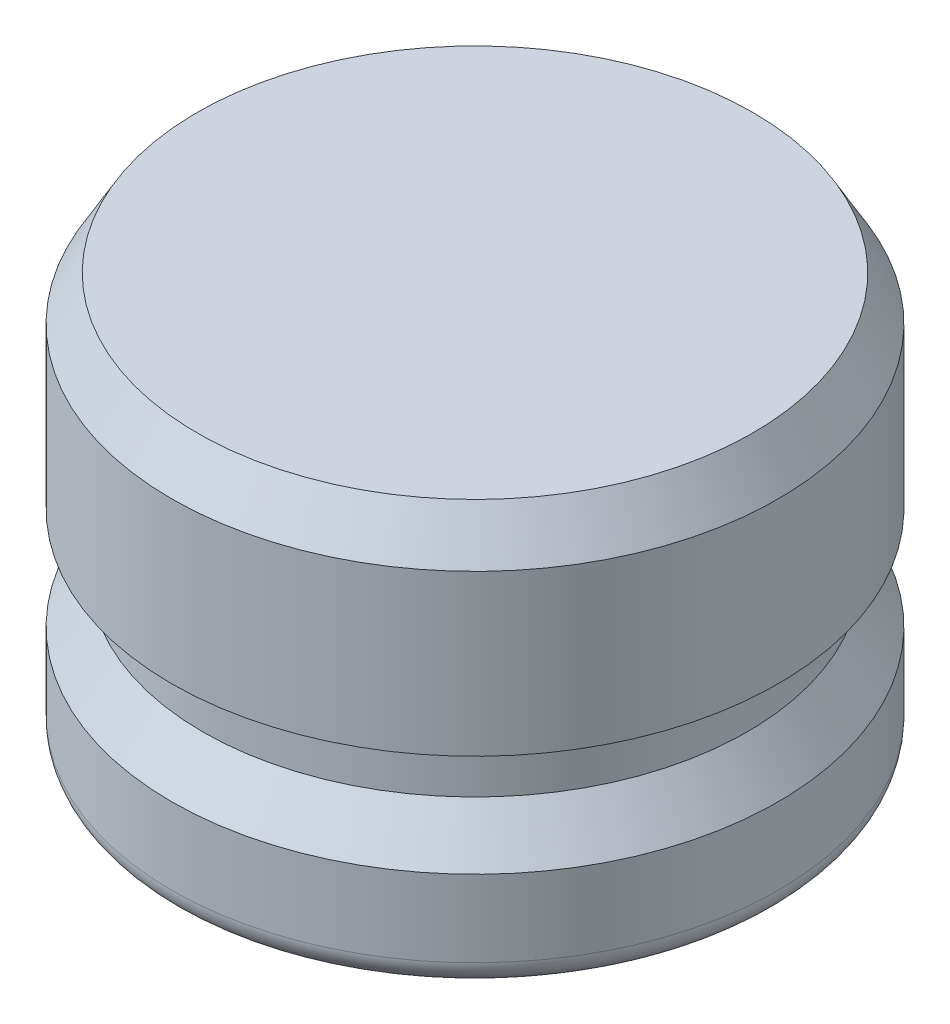
ISO-10303-21;
HEADER;
FILE_DESCRIPTION(('STEP AP214'),'2;1');
FILE_NAME('part.step','',(''),(''),'','','');
FILE_SCHEMA(('AUTOMOTIVE_DESIGN { 1 0 10303 214 1 1 1 1 }'));
ENDSEC;
DATA;
#1=APPLICATION_CONTEXT('core data for automotive mechanical design processes');
#2=APPLICATION_PROTOCOL_DEFINITION('international standard','automotive_design',2000,#1);
#3=PRODUCT_CONTEXT('',#1,'mechanical');
#4=PRODUCT('Part','Part','',(#3));
#5=PRODUCT_RELATED_PRODUCT_CATEGORY('part','',(#4));
#6=PRODUCT_DEFINITION_FORMATION('','',#4);
#7=PRODUCT_DEFINITION_CONTEXT('part definition',#1,'design');
#8=PRODUCT_DEFINITION('design','',#6,#7);
#9=PRODUCT_DEFINITION_SHAPE('','',#8);
#10=(LENGTH_UNIT() NAMED_UNIT(*) SI_UNIT(.MILLI.,.METRE.));
#11=(NAMED_UNIT(*) PLANE_ANGLE_UNIT() SI_UNIT($,.RADIAN.));
#12=(NAMED_UNIT(*) SI_UNIT($,.STERADIAN.) SOLID_ANGLE_UNIT());
#13=UNCERTAINTY_MEASURE_WITH_UNIT(LENGTH_MEASURE(1.E-05),#10,'distance_accuracy_value','');
#14=(GEOMETRIC_REPRESENTATION_CONTEXT(3) GLOBAL_UNCERTAINTY_ASSIGNED_CONTEXT((#13)) GLOBAL_UNIT_ASSIGNED_CONTEXT((#10,
#11,#12)) REPRESENTATION_CONTEXT('',''));
#15=CARTESIAN_POINT('',(0.,0.,0.));
#16=DIRECTION('',(0.,0.,1.));
#17=DIRECTION('',(1.,0.,0.));
#18=AXIS2_PLACEMENT_3D('',#15,#16,#17);
#19=CARTESIAN_POINT('',(0.,0.,0.));
#20=DIRECTION('',(0.,1.,0.));
#21=DIRECTION('',(0.,0.,1.));
#22=AXIS2_PLACEMENT_3D('',#19,#20,#21);
#23=PLANE('',#22);
#24=CARTESIAN_POINT('',(0.,0.,0.));
#25=DIRECTION('',(0.,1.,0.));
#26=DIRECTION('',(0.,0.,1.));
#27=AXIS2_PLACEMENT_3D('',#24,#25,#26);
#28=CIRCLE('',#27,8.62965);
#29=CARTESIAN_POINT('',(0.,0.,8.62965));
#30=VERTEX_POINT('',#29);
#31=EDGE_CURVE('E46',#30,#30,#28,.F.);
#32=ORIENTED_EDGE('',*,*,#31,.T.);
#33=EDGE_LOOP('',(#32));
#34=FACE_BOUND('',#33,.T.);
#35=ADVANCED_FACE('F31',(#34),#23,.F.);
#36=CARTESIAN_POINT('',(0.,0.,0.));
#37=DIRECTION('',(0.,-1.,0.));
#38=DIRECTION('',(0.,0.,-1.));
#39=AXIS2_PLACEMENT_3D('',#36,#37,#38);
#40=CYLINDRICAL_SURFACE('',#39,9.4234);
#41=CARTESIAN_POINT('',(0.,0.793749999999999,0.));
#42=DIRECTION('',(0.,1.,0.));
#43=DIRECTION('',(0.,0.,1.));
#44=AXIS2_PLACEMENT_3D('',#41,#42,#43);
#45=CIRCLE('',#44,9.4234);
#46=CARTESIAN_POINT('',(0.,0.793749999999999,9.4234));
#47=VERTEX_POINT('',#46);
#48=EDGE_CURVE('E42',#47,#47,#45,.T.);
#49=ORIENTED_EDGE('',*,*,#48,.T.);
#50=EDGE_LOOP('',(#49));
#51=FACE_BOUND('',#50,.T.);
#52=CARTESIAN_POINT('',(0.,3.175,0.));
#53=DIRECTION('',(0.,-1.,0.));
#54=DIRECTION('',(0.,0.,-1.));
#55=AXIS2_PLACEMENT_3D('',#52,#53,#54);
#56=CIRCLE('',#55,9.4234);
#57=CARTESIAN_POINT('',(0.,3.175,-9.4234));
#58=VERTEX_POINT('',#57);
#59=EDGE_CURVE('E51',#58,#58,#56,.T.);
#60=ORIENTED_EDGE('',*,*,#59,.T.);
#61=EDGE_LOOP('',(#60));
#62=FACE_BOUND('',#61,.T.);
#63=ADVANCED_FACE('F80',(#51,#62),#40,.T.);
#64=CARTESIAN_POINT('',(0.,4.572,0.));
#65=DIRECTION('',(0.,-1.,0.));
#66=DIRECTION('',(0.,0.,-1.));
#67=AXIS2_PLACEMENT_3D('',#64,#65,#66);
#68=CONICAL_SURFACE('',#67,8.4582,0.604598590093476);
#69=ORIENTED_EDGE('',*,*,#59,.F.);
#70=EDGE_LOOP('',(#69));
#71=FACE_BOUND('',#70,.T.);
#72=CARTESIAN_POINT('',(0.,4.572,0.));
#73=DIRECTION('',(0.,-1.,0.));
#74=DIRECTION('',(0.,0.,-1.));
#75=AXIS2_PLACEMENT_3D('',#72,#73,#74);
#76=CIRCLE('',#75,8.4582);
#77=CARTESIAN_POINT('',(0.,4.572,-8.4582));
#78=VERTEX_POINT('',#77);
#79=EDGE_CURVE('E54',#78,#78,#76,.T.);
#80=ORIENTED_EDGE('',*,*,#79,.T.);
#81=EDGE_LOOP('',(#80));
#82=FACE_BOUND('',#81,.T.);
#83=ADVANCED_FACE('F86',(#71,#82),#68,.T.);
#84=CARTESIAN_POINT('',(0.,0.,0.));
#85=DIRECTION('',(0.,-1.,0.));
#86=DIRECTION('',(0.,0.,-1.));
#87=AXIS2_PLACEMENT_3D('',#84,#85,#86);
#88=CYLINDRICAL_SURFACE('',#87,8.4582);
#89=ORIENTED_EDGE('',*,*,#79,.F.);
#90=EDGE_LOOP('',(#89));
#91=FACE_BOUND('',#90,.T.);
#92=CARTESIAN_POINT('',(0.,6.35,0.));
#93=DIRECTION('',(0.,-1.,0.));
#94=DIRECTION('',(0.,0.,-1.));
#95=AXIS2_PLACEMENT_3D('',#92,#93,#94);
#96=CIRCLE('',#95,8.4582);
#97=CARTESIAN_POINT('',(0.,6.35,-8.4582));
#98=VERTEX_POINT('',#97);
#99=EDGE_CURVE('E57',#98,#98,#96,.T.);
#100=ORIENTED_EDGE('',*,*,#99,.T.);
#101=EDGE_LOOP('',(#100));
#102=FACE_BOUND('',#101,.T.);
#103=ADVANCED_FACE('F76',(#91,#102),#88,.T.);
#104=CARTESIAN_POINT('',(-8.4582,6.35,0.));
#105=DIRECTION('',(0.,1.,0.));
#106=DIRECTION('',(0.,0.,1.));
#107=AXIS2_PLACEMENT_3D('',#104,#105,#106);
#108=PLANE('',#107);
#109=ORIENTED_EDGE('',*,*,#99,.F.);
#110=EDGE_LOOP('',(#109));
#111=FACE_BOUND('',#110,.T.);
#112=CARTESIAN_POINT('',(0.,6.35,0.));
#113=DIRECTION('',(0.,-1.,0.));
#114=DIRECTION('',(0.,0.,-1.));
#115=AXIS2_PLACEMENT_3D('',#112,#113,#114);
#116=CIRCLE('',#115,9.4234);
#117=CARTESIAN_POINT('',(0.,6.35,-9.4234));
#118=VERTEX_POINT('',#117);
#119=EDGE_CURVE('E60',#118,#118,#116,.T.);
#120=ORIENTED_EDGE('',*,*,#119,.T.);
#121=EDGE_LOOP('',(#120));
#122=FACE_BOUND('',#121,.T.);
#123=ADVANCED_FACE('F64',(#111,#122),#108,.F.);
#124=CARTESIAN_POINT('',(0.,0.,0.));
#125=DIRECTION('',(0.,-1.,0.));
#126=DIRECTION('',(0.,0.,-1.));
#127=AXIS2_PLACEMENT_3D('',#124,#125,#126);
#128=CYLINDRICAL_SURFACE('',#127,9.4234);
#129=CARTESIAN_POINT('',(0.,11.3251846714922,0.));
#130=DIRECTION('',(0.,-1.,0.));
#131=DIRECTION('',(0.,0.,-1.));
#132=AXIS2_PLACEMENT_3D('',#129,#130,#131);
#133=CIRCLE('',#132,9.4234);
#134=CARTESIAN_POINT('',(0.,11.3251846714922,-9.4234));
#135=VERTEX_POINT('',#134);
#136=EDGE_CURVE('E38',#135,#135,#133,.T.);
#137=ORIENTED_EDGE('',*,*,#136,.T.);
#138=EDGE_LOOP('',(#137));
#139=FACE_BOUND('',#138,.T.);
#140=ORIENTED_EDGE('',*,*,#119,.F.);
#141=EDGE_LOOP('',(#140));
#142=FACE_BOUND('',#141,.T.);
#143=ADVANCED_FACE('F66',(#139,#142),#128,.T.);
#144=CARTESIAN_POINT('',(-9.4234,12.7,0.));
#145=DIRECTION('',(0.,-1.,0.));
#146=DIRECTION('',(0.,0.,-1.));
#147=AXIS2_PLACEMENT_3D('',#144,#145,#146);
#148=PLANE('',#147);
#149=CARTESIAN_POINT('',(0.,12.7,0.));
#150=DIRECTION('',(0.,-1.,0.));
#151=DIRECTION('',(0.,0.,-1.));
#152=AXIS2_PLACEMENT_3D('',#149,#150,#151);
#153=CIRCLE('',#152,8.62965);
#154=CARTESIAN_POINT('',(0.,12.7,-8.62965));
#155=VERTEX_POINT('',#154);
#156=EDGE_CURVE('E10',#155,#155,#153,.F.);
#157=ORIENTED_EDGE('',*,*,#156,.T.);
#158=EDGE_LOOP('',(#157));
#159=FACE_BOUND('',#158,.T.);
#160=ADVANCED_FACE('F68',(#159),#148,.F.);
#161=CARTESIAN_POINT('',(0.,0.793749999999999,0.));
#162=DIRECTION('',(0.,1.,0.));
#163=DIRECTION('',(0.,0.,1.));
#164=AXIS2_PLACEMENT_3D('',#161,#162,#163);
#165=TOROIDAL_SURFACE('',#164,8.62965,0.79375);
#166=ORIENTED_EDGE('',*,*,#48,.F.);
#167=EDGE_LOOP('',(#166));
#168=FACE_BOUND('',#167,.T.);
#169=ORIENTED_EDGE('',*,*,#31,.F.);
#170=EDGE_LOOP('',(#169));
#171=FACE_BOUND('',#170,.T.);
#172=ADVANCED_FACE('F74',(#168,#171),#165,.T.);
#173=CARTESIAN_POINT('',(0.,11.3251846714922,0.));
#174=DIRECTION('',(0.,-1.,0.));
#175=DIRECTION('',(0.,0.,-1.));
#176=AXIS2_PLACEMENT_3D('',#173,#174,#175);
#177=CONICAL_SURFACE('',#176,9.4234,0.5235987755983);
#178=ORIENTED_EDGE('',*,*,#156,.F.);
#179=EDGE_LOOP('',(#178));
#180=FACE_BOUND('',#179,.T.);
#181=ORIENTED_EDGE('',*,*,#136,.F.);
#182=EDGE_LOOP('',(#181));
#183=FACE_BOUND('',#182,.T.);
#184=ADVANCED_FACE('F33',(#180,#183),#177,.T.);
#185=CLOSED_SHELL('',(#35,#63,#83,#103,#123,#143,#160,#172,#184));
#186=MANIFOLD_SOLID_BREP('B2',#185);
#187=ADVANCED_BREP_SHAPE_REPRESENTATION('',(#18,#186),#14);
#188=SHAPE_DEFINITION_REPRESENTATION(#9,#187);
ENDSEC;
END-ISO-10303-21;
